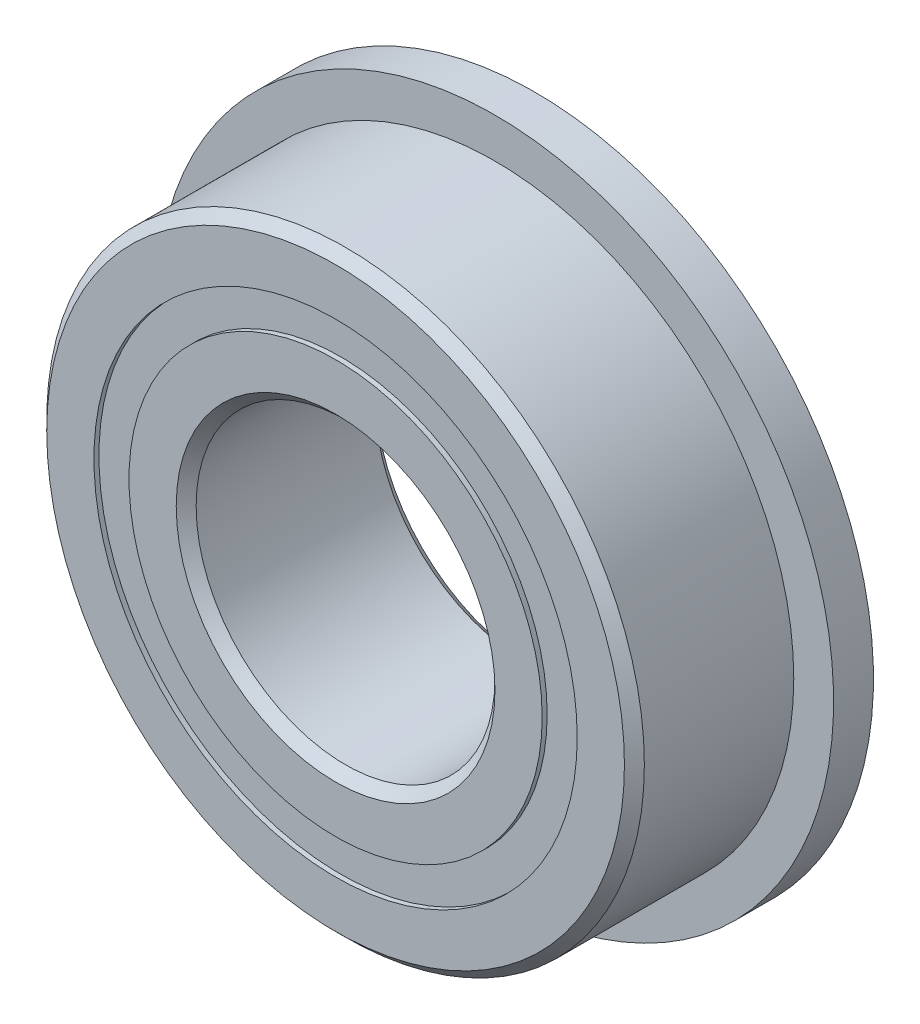
ISO-10303-21;
HEADER;
FILE_DESCRIPTION(('STEP AP214'),'2;1');
FILE_NAME('part.step','',(''),(''),'','','');
FILE_SCHEMA(('AUTOMOTIVE_DESIGN { 1 0 10303 214 1 1 1 1 }'));
ENDSEC;
DATA;
#1=APPLICATION_CONTEXT('core data for automotive mechanical design processes');
#2=APPLICATION_PROTOCOL_DEFINITION('international standard','automotive_design',2000,#1);
#3=PRODUCT_CONTEXT('',#1,'mechanical');
#4=PRODUCT('Part','Part','',(#3));
#5=PRODUCT_RELATED_PRODUCT_CATEGORY('part','',(#4));
#6=PRODUCT_DEFINITION_FORMATION('','',#4);
#7=PRODUCT_DEFINITION_CONTEXT('part definition',#1,'design');
#8=PRODUCT_DEFINITION('design','',#6,#7);
#9=PRODUCT_DEFINITION_SHAPE('','',#8);
#10=(LENGTH_UNIT() NAMED_UNIT(*) SI_UNIT(.MILLI.,.METRE.));
#11=(NAMED_UNIT(*) PLANE_ANGLE_UNIT() SI_UNIT($,.RADIAN.));
#12=(NAMED_UNIT(*) SI_UNIT($,.STERADIAN.) SOLID_ANGLE_UNIT());
#13=UNCERTAINTY_MEASURE_WITH_UNIT(LENGTH_MEASURE(1.E-05),#10,'distance_accuracy_value','');
#14=(GEOMETRIC_REPRESENTATION_CONTEXT(3) GLOBAL_UNCERTAINTY_ASSIGNED_CONTEXT((#13)) GLOBAL_UNIT_ASSIGNED_CONTEXT((#10,
#11,#12)) REPRESENTATION_CONTEXT('',''));
#15=CARTESIAN_POINT('',(0.,0.,0.));
#16=DIRECTION('',(0.,0.,1.));
#17=DIRECTION('',(1.,0.,0.));
#18=AXIS2_PLACEMENT_3D('',#15,#16,#17);
#19=CARTESIAN_POINT('',(0.,4.85164835164835,-1.9));
#20=DIRECTION('',(0.,0.,1.));
#21=DIRECTION('',(1.,0.,0.));
#22=AXIS2_PLACEMENT_3D('',#19,#20,#21);
#23=PLANE('',#22);
#24=CARTESIAN_POINT('',(0.,0.,-1.9));
#25=DIRECTION('',(0.,0.,1.));
#26=DIRECTION('',(1.,0.,0.));
#27=AXIS2_PLACEMENT_3D('',#24,#25,#26);
#28=CIRCLE('',#27,4.85164835164835);
#29=CARTESIAN_POINT('',(4.85164835164835,0.,-1.9));
#30=VERTEX_POINT('',#29);
#31=EDGE_CURVE('E57',#30,#30,#28,.T.);
#32=ORIENTED_EDGE('',*,*,#31,.F.);
#33=EDGE_LOOP('',(#32));
#34=FACE_BOUND('',#33,.T.);
#35=CARTESIAN_POINT('',(0.,0.,-1.9));
#36=DIRECTION('',(0.,0.,1.));
#37=DIRECTION('',(1.,0.,0.));
#38=AXIS2_PLACEMENT_3D('',#35,#36,#37);
#39=CIRCLE('',#38,4.14835164835165);
#40=CARTESIAN_POINT('',(4.14835164835165,0.,-1.9));
#41=VERTEX_POINT('',#40);
#42=EDGE_CURVE('E11',#41,#41,#39,.T.);
#43=ORIENTED_EDGE('',*,*,#42,.T.);
#44=EDGE_LOOP('',(#43));
#45=FACE_BOUND('',#44,.T.);
#46=ADVANCED_FACE('F43',(#34,#45),#23,.F.);
#47=CARTESIAN_POINT('',(0.,0.,2.));
#48=DIRECTION('',(0.,0.,1.));
#49=DIRECTION('',(1.,0.,0.));
#50=AXIS2_PLACEMENT_3D('',#47,#48,#49);
#51=CYLINDRICAL_SURFACE('',#50,4.14835164835165);
#52=ORIENTED_EDGE('',*,*,#42,.F.);
#53=EDGE_LOOP('',(#52));
#54=FACE_BOUND('',#53,.T.);
#55=CARTESIAN_POINT('',(0.,0.,-0.955918417024762));
#56=DIRECTION('',(0.,0.,1.));
#57=DIRECTION('',(1.,0.,0.));
#58=AXIS2_PLACEMENT_3D('',#55,#56,#57);
#59=CIRCLE('',#58,4.14835164835165);
#60=CARTESIAN_POINT('',(4.14835164835165,0.,-0.955918417024762));
#61=VERTEX_POINT('',#60);
#62=EDGE_CURVE('E49',#61,#61,#59,.T.);
#63=ORIENTED_EDGE('',*,*,#62,.T.);
#64=EDGE_LOOP('',(#63));
#65=FACE_BOUND('',#64,.T.);
#66=ADVANCED_FACE('F66',(#54,#65),#51,.F.);
#67=CARTESIAN_POINT('',(0.,4.85164835164835,-0.955918417024762));
#68=DIRECTION('',(0.,0.,-1.));
#69=DIRECTION('',(-1.,0.,0.));
#70=AXIS2_PLACEMENT_3D('',#67,#68,#69);
#71=PLANE('',#70);
#72=ORIENTED_EDGE('',*,*,#62,.F.);
#73=EDGE_LOOP('',(#72));
#74=FACE_BOUND('',#73,.T.);
#75=CARTESIAN_POINT('',(0.,0.,-0.955918417024762));
#76=DIRECTION('',(0.,0.,1.));
#77=DIRECTION('',(1.,0.,0.));
#78=AXIS2_PLACEMENT_3D('',#75,#76,#77);
#79=CIRCLE('',#78,4.85164835164835);
#80=CARTESIAN_POINT('',(4.85164835164835,0.,-0.955918417024762));
#81=VERTEX_POINT('',#80);
#82=EDGE_CURVE('E53',#81,#81,#79,.T.);
#83=ORIENTED_EDGE('',*,*,#82,.T.);
#84=EDGE_LOOP('',(#83));
#85=FACE_BOUND('',#84,.T.);
#86=ADVANCED_FACE('F70',(#74,#85),#71,.F.);
#87=CARTESIAN_POINT('',(0.,0.,2.));
#88=DIRECTION('',(0.,0.,1.));
#89=DIRECTION('',(1.,0.,0.));
#90=AXIS2_PLACEMENT_3D('',#87,#88,#89);
#91=CYLINDRICAL_SURFACE('',#90,4.85164835164835);
#92=ORIENTED_EDGE('',*,*,#82,.F.);
#93=EDGE_LOOP('',(#92));
#94=FACE_BOUND('',#93,.T.);
#95=ORIENTED_EDGE('',*,*,#31,.T.);
#96=EDGE_LOOP('',(#95));
#97=FACE_BOUND('',#96,.T.);
#98=ADVANCED_FACE('F63',(#94,#97),#91,.T.);
#99=CLOSED_SHELL('',(#46,#66,#86,#98));
#100=MANIFOLD_SOLID_BREP('B2',#99);
#101=CARTESIAN_POINT('',(0.,4.85164835164835,1.9));
#102=DIRECTION('',(0.,0.,-1.));
#103=DIRECTION('',(-1.,0.,0.));
#104=AXIS2_PLACEMENT_3D('',#101,#102,#103);
#105=PLANE('',#104);
#106=CARTESIAN_POINT('',(0.,0.,1.9));
#107=DIRECTION('',(0.,0.,1.));
#108=DIRECTION('',(1.,0.,0.));
#109=AXIS2_PLACEMENT_3D('',#106,#107,#108);
#110=CIRCLE('',#109,4.14835164835165);
#111=CARTESIAN_POINT('',(4.14835164835165,0.,1.9));
#112=VERTEX_POINT('',#111);
#113=EDGE_CURVE('E42',#112,#112,#110,.T.);
#114=ORIENTED_EDGE('',*,*,#113,.F.);
#115=EDGE_LOOP('',(#114));
#116=FACE_BOUND('',#115,.T.);
#117=CARTESIAN_POINT('',(0.,0.,1.9));
#118=DIRECTION('',(0.,0.,1.));
#119=DIRECTION('',(1.,0.,0.));
#120=AXIS2_PLACEMENT_3D('',#117,#118,#119);
#121=CIRCLE('',#120,4.85164835164835);
#122=CARTESIAN_POINT('',(4.85164835164835,0.,1.9));
#123=VERTEX_POINT('',#122);
#124=EDGE_CURVE('E125',#123,#123,#121,.T.);
#125=ORIENTED_EDGE('',*,*,#124,.T.);
#126=EDGE_LOOP('',(#125));
#127=FACE_BOUND('',#126,.T.);
#128=ADVANCED_FACE('F111',(#116,#127),#105,.F.);
#129=CARTESIAN_POINT('',(0.,0.,2.));
#130=DIRECTION('',(0.,0.,1.));
#131=DIRECTION('',(1.,0.,0.));
#132=AXIS2_PLACEMENT_3D('',#129,#130,#131);
#133=CYLINDRICAL_SURFACE('',#132,4.14835164835165);
#134=CARTESIAN_POINT('',(0.,0.,0.955918417024761));
#135=DIRECTION('',(0.,0.,1.));
#136=DIRECTION('',(1.,0.,0.));
#137=AXIS2_PLACEMENT_3D('',#134,#135,#136);
#138=CIRCLE('',#137,4.14835164835165);
#139=CARTESIAN_POINT('',(4.14835164835165,0.,0.955918417024761));
#140=VERTEX_POINT('',#139);
#141=EDGE_CURVE('E117',#140,#140,#138,.T.);
#142=ORIENTED_EDGE('',*,*,#141,.F.);
#143=EDGE_LOOP('',(#142));
#144=FACE_BOUND('',#143,.T.);
#145=ORIENTED_EDGE('',*,*,#113,.T.);
#146=EDGE_LOOP('',(#145));
#147=FACE_BOUND('',#146,.T.);
#148=ADVANCED_FACE('F140',(#144,#147),#133,.F.);
#149=CARTESIAN_POINT('',(0.,4.85164835164835,0.955918417024761));
#150=DIRECTION('',(0.,0.,1.));
#151=DIRECTION('',(1.,0.,0.));
#152=AXIS2_PLACEMENT_3D('',#149,#150,#151);
#153=PLANE('',#152);
#154=CARTESIAN_POINT('',(0.,0.,0.955918417024761));
#155=DIRECTION('',(0.,0.,1.));
#156=DIRECTION('',(1.,0.,0.));
#157=AXIS2_PLACEMENT_3D('',#154,#155,#156);
#158=CIRCLE('',#157,4.85164835164835);
#159=CARTESIAN_POINT('',(4.85164835164835,0.,0.955918417024761));
#160=VERTEX_POINT('',#159);
#161=EDGE_CURVE('E121',#160,#160,#158,.T.);
#162=ORIENTED_EDGE('',*,*,#161,.F.);
#163=EDGE_LOOP('',(#162));
#164=FACE_BOUND('',#163,.T.);
#165=ORIENTED_EDGE('',*,*,#141,.T.);
#166=EDGE_LOOP('',(#165));
#167=FACE_BOUND('',#166,.T.);
#168=ADVANCED_FACE('F135',(#164,#167),#153,.F.);
#169=CARTESIAN_POINT('',(0.,0.,2.));
#170=DIRECTION('',(0.,0.,1.));
#171=DIRECTION('',(1.,0.,0.));
#172=AXIS2_PLACEMENT_3D('',#169,#170,#171);
#173=CYLINDRICAL_SURFACE('',#172,4.85164835164835);
#174=ORIENTED_EDGE('',*,*,#124,.F.);
#175=EDGE_LOOP('',(#174));
#176=FACE_BOUND('',#175,.T.);
#177=ORIENTED_EDGE('',*,*,#161,.T.);
#178=EDGE_LOOP('',(#177));
#179=FACE_BOUND('',#178,.T.);
#180=ADVANCED_FACE('F132',(#176,#179),#173,.T.);
#181=CLOSED_SHELL('',(#128,#148,#168,#180));
#182=MANIFOLD_SOLID_BREP('B6',#181);
#183=CARTESIAN_POINT('',(-2.24999999999995,3.89711431703,0.));
#184=DIRECTION('',(0.,0.,1.));
#185=DIRECTION('',(-0.499999999999989,0.866025403784445,0.));
#186=AXIS2_PLACEMENT_3D('',#183,#184,#185);
#187=SPHERICAL_SURFACE('',#186,0.955918417024761);
#188=CARTESIAN_POINT('',(-2.24999999999995,3.89711431703,0.955918417024761));
#189=VERTEX_POINT('',#188);
#190=VERTEX_LOOP('',#189);
#191=FACE_BOUND('',#190,.T.);
#192=ADVANCED_FACE('F181',(#191),#187,.T.);
#193=CLOSED_SHELL('',(#192));
#194=MANIFOLD_SOLID_BREP('B37',#193);
#195=CARTESIAN_POINT('',(-3.89711431702995,2.25000000000005,0.));
#196=DIRECTION('',(0.,0.,1.));
#197=DIRECTION('',(-0.866025403784433,0.50000000000001,0.));
#198=AXIS2_PLACEMENT_3D('',#195,#196,#197);
#199=SPHERICAL_SURFACE('',#198,0.955918417024761);
#200=CARTESIAN_POINT('',(-3.89711431702995,2.25000000000005,0.955918417024761));
#201=VERTEX_POINT('',#200);
#202=VERTEX_LOOP('',#201);
#203=FACE_BOUND('',#202,.T.);
#204=ADVANCED_FACE('F201',(#203),#199,.T.);
#205=CLOSED_SHELL('',(#204));
#206=MANIFOLD_SOLID_BREP('B107',#205);
#207=CARTESIAN_POINT('',(-4.5,0.,0.));
#208=DIRECTION('',(0.,0.,1.));
#209=DIRECTION('',(-1.,0.,0.));
#210=AXIS2_PLACEMENT_3D('',#207,#208,#209);
#211=SPHERICAL_SURFACE('',#210,0.955918417024761);
#212=CARTESIAN_POINT('',(-4.5,0.,0.955918417024761));
#213=VERTEX_POINT('',#212);
#214=VERTEX_LOOP('',#213);
#215=FACE_BOUND('',#214,.T.);
#216=ADVANCED_FACE('F222',(#215),#211,.T.);
#217=CLOSED_SHELL('',(#216));
#218=MANIFOLD_SOLID_BREP('B177',#217);
#219=CARTESIAN_POINT('',(-3.89711431703,-2.24999999999996,0.));
#220=DIRECTION('',(0.,0.,1.));
#221=DIRECTION('',(-0.866025403784443,-0.499999999999992,0.));
#222=AXIS2_PLACEMENT_3D('',#219,#220,#221);
#223=SPHERICAL_SURFACE('',#222,0.955918417024761);
#224=CARTESIAN_POINT('',(-3.89711431703,-2.24999999999996,0.955918417024761));
#225=VERTEX_POINT('',#224);
#226=VERTEX_LOOP('',#225);
#227=FACE_BOUND('',#226,.T.);
#228=ADVANCED_FACE('F245',(#227),#223,.T.);
#229=CLOSED_SHELL('',(#228));
#230=MANIFOLD_SOLID_BREP('B197',#229);
#231=CARTESIAN_POINT('',(-2.25000000000003,-3.89711431702996,0.));
#232=DIRECTION('',(0.,0.,1.));
#233=DIRECTION('',(-0.500000000000007,-0.866025403784435,0.));
#234=AXIS2_PLACEMENT_3D('',#231,#232,#233);
#235=SPHERICAL_SURFACE('',#234,0.955918417024761);
#236=CARTESIAN_POINT('',(-2.25000000000003,-3.89711431702996,0.955918417024761));
#237=VERTEX_POINT('',#236);
#238=VERTEX_LOOP('',#237);
#239=FACE_BOUND('',#238,.T.);
#240=ADVANCED_FACE('F265',(#239),#235,.T.);
#241=CLOSED_SHELL('',(#240));
#242=MANIFOLD_SOLID_BREP('B218',#241);
#243=CARTESIAN_POINT('',(0.,-4.5,0.));
#244=DIRECTION('',(0.,0.,1.));
#245=DIRECTION('',(0.,-1.,0.));
#246=AXIS2_PLACEMENT_3D('',#243,#244,#245);
#247=SPHERICAL_SURFACE('',#246,0.955918417024761);
#248=CARTESIAN_POINT('',(0.,-4.5,0.955918417024761));
#249=VERTEX_POINT('',#248);
#250=VERTEX_LOOP('',#249);
#251=FACE_BOUND('',#250,.T.);
#252=ADVANCED_FACE('F285',(#251),#247,.T.);
#253=CLOSED_SHELL('',(#252));
#254=MANIFOLD_SOLID_BREP('B241',#253);
#255=CARTESIAN_POINT('',(2.24999999999998,-3.89711431702999,0.));
#256=DIRECTION('',(0.,0.,1.));
#257=DIRECTION('',(0.499999999999995,-0.866025403784442,0.));
#258=AXIS2_PLACEMENT_3D('',#255,#256,#257);
#259=SPHERICAL_SURFACE('',#258,0.955918417024761);
#260=CARTESIAN_POINT('',(2.24999999999998,-3.89711431702999,0.955918417024761));
#261=VERTEX_POINT('',#260);
#262=VERTEX_LOOP('',#261);
#263=FACE_BOUND('',#262,.T.);
#264=ADVANCED_FACE('F305',(#263),#259,.T.);
#265=CLOSED_SHELL('',(#264));
#266=MANIFOLD_SOLID_BREP('B261',#265);
#267=CARTESIAN_POINT('',(3.89711431702996,-2.25000000000002,0.));
#268=DIRECTION('',(0.,0.,1.));
#269=DIRECTION('',(0.866025403784436,-0.500000000000004,0.));
#270=AXIS2_PLACEMENT_3D('',#267,#268,#269);
#271=SPHERICAL_SURFACE('',#270,0.955918417024761);
#272=CARTESIAN_POINT('',(3.89711431702996,-2.25000000000002,0.955918417024761));
#273=VERTEX_POINT('',#272);
#274=VERTEX_LOOP('',#273);
#275=FACE_BOUND('',#274,.T.);
#276=ADVANCED_FACE('F325',(#275),#271,.T.);
#277=CLOSED_SHELL('',(#276));
#278=MANIFOLD_SOLID_BREP('B281',#277);
#279=CARTESIAN_POINT('',(4.5,0.,0.));
#280=DIRECTION('',(0.,0.,1.));
#281=DIRECTION('',(1.,0.,0.));
#282=AXIS2_PLACEMENT_3D('',#279,#280,#281);
#283=SPHERICAL_SURFACE('',#282,0.955918417024761);
#284=CARTESIAN_POINT('',(4.5,0.,0.955918417024761));
#285=VERTEX_POINT('',#284);
#286=VERTEX_LOOP('',#285);
#287=FACE_BOUND('',#286,.T.);
#288=ADVANCED_FACE('F345',(#287),#283,.T.);
#289=CLOSED_SHELL('',(#288));
#290=MANIFOLD_SOLID_BREP('B301',#289);
#291=CARTESIAN_POINT('',(3.89711431702998,2.24999999999999,0.));
#292=DIRECTION('',(0.,0.,1.));
#293=DIRECTION('',(0.86602540378444,0.499999999999998,0.));
#294=AXIS2_PLACEMENT_3D('',#291,#292,#293);
#295=SPHERICAL_SURFACE('',#294,0.955918417024761);
#296=CARTESIAN_POINT('',(3.89711431702998,2.24999999999999,0.955918417024761));
#297=VERTEX_POINT('',#296);
#298=VERTEX_LOOP('',#297);
#299=FACE_BOUND('',#298,.T.);
#300=ADVANCED_FACE('F365',(#299),#295,.T.);
#301=CLOSED_SHELL('',(#300));
#302=MANIFOLD_SOLID_BREP('B321',#301);
#303=CARTESIAN_POINT('',(2.25,3.89711431702997,0.));
#304=DIRECTION('',(0.,0.,1.));
#305=DIRECTION('',(0.500000000000001,0.866025403784438,0.));
#306=AXIS2_PLACEMENT_3D('',#303,#304,#305);
#307=SPHERICAL_SURFACE('',#306,0.955918417024761);
#308=CARTESIAN_POINT('',(2.25,3.89711431702997,0.955918417024761));
#309=VERTEX_POINT('',#308);
#310=VERTEX_LOOP('',#309);
#311=FACE_BOUND('',#310,.T.);
#312=ADVANCED_FACE('F385',(#311),#307,.T.);
#313=CLOSED_SHELL('',(#312));
#314=MANIFOLD_SOLID_BREP('B341',#313);
#315=CARTESIAN_POINT('',(0.,4.5,0.));
#316=DIRECTION('',(0.,0.,1.));
#317=DIRECTION('',(0.,1.,0.));
#318=AXIS2_PLACEMENT_3D('',#315,#316,#317);
#319=SPHERICAL_SURFACE('',#318,0.955918417024761);
#320=CARTESIAN_POINT('',(0.,4.5,0.955918417024761));
#321=VERTEX_POINT('',#320);
#322=VERTEX_LOOP('',#321);
#323=FACE_BOUND('',#322,.T.);
#324=ADVANCED_FACE('F408',(#323),#319,.T.);
#325=CLOSED_SHELL('',(#324));
#326=MANIFOLD_SOLID_BREP('B361',#325);
#327=CARTESIAN_POINT('',(0.,4.14835164835165,2.));
#328=DIRECTION('',(0.,0.,-1.));
#329=DIRECTION('',(-1.,0.,0.));
#330=AXIS2_PLACEMENT_3D('',#327,#328,#329);
#331=PLANE('',#330);
#332=CARTESIAN_POINT('',(0.,0.,2.));
#333=DIRECTION('',(0.,0.,1.));
#334=DIRECTION('',(1.,0.,0.));
#335=AXIS2_PLACEMENT_3D('',#332,#333,#334);
#336=CIRCLE('',#335,3.2);
#337=CARTESIAN_POINT('',(3.2,0.,2.));
#338=VERTEX_POINT('',#337);
#339=EDGE_CURVE('E459',#338,#338,#336,.T.);
#340=ORIENTED_EDGE('',*,*,#339,.F.);
#341=EDGE_LOOP('',(#340));
#342=FACE_BOUND('',#341,.T.);
#343=CARTESIAN_POINT('',(0.,0.,2.));
#344=DIRECTION('',(0.,0.,1.));
#345=DIRECTION('',(1.,0.,0.));
#346=AXIS2_PLACEMENT_3D('',#343,#344,#345);
#347=CIRCLE('',#346,4.14835164835165);
#348=CARTESIAN_POINT('',(4.14835164835165,0.,2.));
#349=VERTEX_POINT('',#348);
#350=EDGE_CURVE('E407',#349,#349,#347,.T.);
#351=ORIENTED_EDGE('',*,*,#350,.T.);
#352=EDGE_LOOP('',(#351));
#353=FACE_BOUND('',#352,.T.);
#354=ADVANCED_FACE('F431',(#342,#353),#331,.F.);
#355=CARTESIAN_POINT('',(0.,0.,2.));
#356=DIRECTION('',(0.,0.,1.));
#357=DIRECTION('',(1.,0.,0.));
#358=AXIS2_PLACEMENT_3D('',#355,#356,#357);
#359=CYLINDRICAL_SURFACE('',#358,4.14835164835165);
#360=ORIENTED_EDGE('',*,*,#350,.F.);
#361=EDGE_LOOP('',(#360));
#362=FACE_BOUND('',#361,.T.);
#363=CARTESIAN_POINT('',(0.,0.,0.888888888888889));
#364=DIRECTION('',(0.,0.,1.));
#365=DIRECTION('',(1.,0.,0.));
#366=AXIS2_PLACEMENT_3D('',#363,#364,#365);
#367=CIRCLE('',#366,4.14835164835165);
#368=CARTESIAN_POINT('',(4.14835164835165,0.,0.888888888888889));
#369=VERTEX_POINT('',#368);
#370=EDGE_CURVE('E437',#369,#369,#367,.T.);
#371=ORIENTED_EDGE('',*,*,#370,.T.);
#372=EDGE_LOOP('',(#371));
#373=FACE_BOUND('',#372,.T.);
#374=ADVANCED_FACE('F466',(#362,#373),#359,.T.);
#375=CARTESIAN_POINT('',(0.,0.,0.));
#376=DIRECTION('',(0.,0.,1.));
#377=DIRECTION('',(1.,0.,0.));
#378=AXIS2_PLACEMENT_3D('',#375,#376,#377);
#379=TOROIDAL_SURFACE('',#378,4.5,0.95591841702476);
#380=ORIENTED_EDGE('',*,*,#370,.F.);
#381=EDGE_LOOP('',(#380));
#382=FACE_BOUND('',#381,.T.);
#383=CARTESIAN_POINT('',(0.,0.,-0.88888888888889));
#384=DIRECTION('',(0.,0.,1.));
#385=DIRECTION('',(1.,0.,0.));
#386=AXIS2_PLACEMENT_3D('',#383,#384,#385);
#387=CIRCLE('',#386,4.14835164835165);
#388=CARTESIAN_POINT('',(4.14835164835165,0.,-0.88888888888889));
#389=VERTEX_POINT('',#388);
#390=EDGE_CURVE('E441',#389,#389,#387,.T.);
#391=ORIENTED_EDGE('',*,*,#390,.T.);
#392=EDGE_LOOP('',(#391));
#393=FACE_BOUND('',#392,.T.);
#394=ADVANCED_FACE('F470',(#382,#393),#379,.F.);
#395=CARTESIAN_POINT('',(0.,0.,2.));
#396=DIRECTION('',(0.,0.,1.));
#397=DIRECTION('',(1.,0.,0.));
#398=AXIS2_PLACEMENT_3D('',#395,#396,#397);
#399=CYLINDRICAL_SURFACE('',#398,4.14835164835165);
#400=ORIENTED_EDGE('',*,*,#390,.F.);
#401=EDGE_LOOP('',(#400));
#402=FACE_BOUND('',#401,.T.);
#403=CARTESIAN_POINT('',(0.,0.,-2.));
#404=DIRECTION('',(0.,0.,1.));
#405=DIRECTION('',(1.,0.,0.));
#406=AXIS2_PLACEMENT_3D('',#403,#404,#405);
#407=CIRCLE('',#406,4.14835164835165);
#408=CARTESIAN_POINT('',(4.14835164835165,0.,-2.));
#409=VERTEX_POINT('',#408);
#410=EDGE_CURVE('E445',#409,#409,#407,.T.);
#411=ORIENTED_EDGE('',*,*,#410,.T.);
#412=EDGE_LOOP('',(#411));
#413=FACE_BOUND('',#412,.T.);
#414=ADVANCED_FACE('F475',(#402,#413),#399,.T.);
#415=CARTESIAN_POINT('',(0.,3.2,-2.));
#416=DIRECTION('',(0.,0.,1.));
#417=DIRECTION('',(1.,0.,0.));
#418=AXIS2_PLACEMENT_3D('',#415,#416,#417);
#419=PLANE('',#418);
#420=ORIENTED_EDGE('',*,*,#410,.F.);
#421=EDGE_LOOP('',(#420));
#422=FACE_BOUND('',#421,.T.);
#423=CARTESIAN_POINT('',(0.,0.,-2.));
#424=DIRECTION('',(0.,0.,1.));
#425=DIRECTION('',(1.,0.,0.));
#426=AXIS2_PLACEMENT_3D('',#423,#424,#425);
#427=CIRCLE('',#426,3.2);
#428=CARTESIAN_POINT('',(3.2,0.,-2.));
#429=VERTEX_POINT('',#428);
#430=EDGE_CURVE('E450',#429,#429,#427,.T.);
#431=ORIENTED_EDGE('',*,*,#430,.T.);
#432=EDGE_LOOP('',(#431));
#433=FACE_BOUND('',#432,.T.);
#434=ADVANCED_FACE('F481',(#422,#433),#419,.F.);
#435=CARTESIAN_POINT('',(0.,0.,-1.8));
#436=DIRECTION('',(0.,0.,-1.));
#437=DIRECTION('',(-1.,0.,0.));
#438=AXIS2_PLACEMENT_3D('',#435,#436,#437);
#439=CONICAL_SURFACE('',#438,3.,0.785398163397452);
#440=ORIENTED_EDGE('',*,*,#430,.F.);
#441=EDGE_LOOP('',(#440));
#442=FACE_BOUND('',#441,.T.);
#443=CARTESIAN_POINT('',(0.,0.,-1.8));
#444=DIRECTION('',(0.,0.,1.));
#445=DIRECTION('',(1.,0.,0.));
#446=AXIS2_PLACEMENT_3D('',#443,#444,#445);
#447=CIRCLE('',#446,3.);
#448=CARTESIAN_POINT('',(3.,0.,-1.8));
#449=VERTEX_POINT('',#448);
#450=EDGE_CURVE('E453',#449,#449,#447,.T.);
#451=ORIENTED_EDGE('',*,*,#450,.T.);
#452=EDGE_LOOP('',(#451));
#453=FACE_BOUND('',#452,.T.);
#454=ADVANCED_FACE('F485',(#442,#453),#439,.F.);
#455=CARTESIAN_POINT('',(0.,0.,2.));
#456=DIRECTION('',(0.,0.,1.));
#457=DIRECTION('',(1.,0.,0.));
#458=AXIS2_PLACEMENT_3D('',#455,#456,#457);
#459=CYLINDRICAL_SURFACE('',#458,3.);
#460=ORIENTED_EDGE('',*,*,#450,.F.);
#461=EDGE_LOOP('',(#460));
#462=FACE_BOUND('',#461,.T.);
#463=CARTESIAN_POINT('',(0.,0.,1.8));
#464=DIRECTION('',(0.,0.,1.));
#465=DIRECTION('',(1.,0.,0.));
#466=AXIS2_PLACEMENT_3D('',#463,#464,#465);
#467=CIRCLE('',#466,3.);
#468=CARTESIAN_POINT('',(3.,0.,1.8));
#469=VERTEX_POINT('',#468);
#470=EDGE_CURVE('E456',#469,#469,#467,.T.);
#471=ORIENTED_EDGE('',*,*,#470,.T.);
#472=EDGE_LOOP('',(#471));
#473=FACE_BOUND('',#472,.T.);
#474=ADVANCED_FACE('F489',(#462,#473),#459,.F.);
#475=CARTESIAN_POINT('',(0.,0.,2.));
#476=DIRECTION('',(0.,0.,1.));
#477=DIRECTION('',(1.,0.,0.));
#478=AXIS2_PLACEMENT_3D('',#475,#476,#477);
#479=CONICAL_SURFACE('',#478,3.2,0.785398163397443);
#480=ORIENTED_EDGE('',*,*,#470,.F.);
#481=EDGE_LOOP('',(#480));
#482=FACE_BOUND('',#481,.T.);
#483=ORIENTED_EDGE('',*,*,#339,.T.);
#484=EDGE_LOOP('',(#483));
#485=FACE_BOUND('',#484,.T.);
#486=ADVANCED_FACE('F463',(#482,#485),#479,.F.);
#487=CLOSED_SHELL('',(#354,#374,#394,#414,#434,#454,#474,#486));
#488=MANIFOLD_SOLID_BREP('B381',#487);
#489=CARTESIAN_POINT('',(0.,0.,1.8));
#490=DIRECTION('',(0.,0.,-1.));
#491=DIRECTION('',(-1.,0.,0.));
#492=AXIS2_PLACEMENT_3D('',#489,#490,#491);
#493=CONICAL_SURFACE('',#492,6.,0.785398163397449);
#494=CARTESIAN_POINT('',(0.,0.,2.));
#495=DIRECTION('',(0.,0.,1.));
#496=DIRECTION('',(1.,0.,0.));
#497=AXIS2_PLACEMENT_3D('',#494,#495,#496);
#498=CIRCLE('',#497,5.8);
#499=CARTESIAN_POINT('',(5.8,0.,2.));
#500=VERTEX_POINT('',#499);
#501=EDGE_CURVE('E577',#500,#500,#498,.T.);
#502=ORIENTED_EDGE('',*,*,#501,.F.);
#503=EDGE_LOOP('',(#502));
#504=FACE_BOUND('',#503,.T.);
#505=CARTESIAN_POINT('',(0.,0.,1.8));
#506=DIRECTION('',(0.,0.,1.));
#507=DIRECTION('',(1.,0.,0.));
#508=AXIS2_PLACEMENT_3D('',#505,#506,#507);
#509=CIRCLE('',#508,6.);
#510=CARTESIAN_POINT('',(6.,0.,1.8));
#511=VERTEX_POINT('',#510);
#512=EDGE_CURVE('E430',#511,#511,#509,.T.);
#513=ORIENTED_EDGE('',*,*,#512,.T.);
#514=EDGE_LOOP('',(#513));
#515=FACE_BOUND('',#514,.T.);
#516=ADVANCED_FACE('F555',(#504,#515),#493,.T.);
#517=CARTESIAN_POINT('',(0.,0.,2.));
#518=DIRECTION('',(0.,0.,1.));
#519=DIRECTION('',(1.,0.,0.));
#520=AXIS2_PLACEMENT_3D('',#517,#518,#519);
#521=CYLINDRICAL_SURFACE('',#520,6.);
#522=CARTESIAN_POINT('',(0.,0.,-1.2));
#523=DIRECTION('',(0.,0.,1.));
#524=DIRECTION('',(1.,0.,0.));
#525=AXIS2_PLACEMENT_3D('',#522,#523,#524);
#526=CIRCLE('',#525,6.);
#527=CARTESIAN_POINT('',(6.,0.,-1.2));
#528=VERTEX_POINT('',#527);
#529=EDGE_CURVE('E580',#528,#528,#526,.T.);
#530=ORIENTED_EDGE('',*,*,#529,.T.);
#531=EDGE_LOOP('',(#530));
#532=FACE_BOUND('',#531,.T.);
#533=ORIENTED_EDGE('',*,*,#512,.F.);
#534=EDGE_LOOP('',(#533));
#535=FACE_BOUND('',#534,.T.);
#536=ADVANCED_FACE('F600',(#532,#535),#521,.T.);
#537=CARTESIAN_POINT('',(0.,5.8,-2.));
#538=DIRECTION('',(0.,0.,1.));
#539=DIRECTION('',(1.,0.,0.));
#540=AXIS2_PLACEMENT_3D('',#537,#538,#539);
#541=PLANE('',#540);
#542=CARTESIAN_POINT('',(0.,0.,-2.));
#543=DIRECTION('',(0.,0.,1.));
#544=DIRECTION('',(1.,0.,0.));
#545=AXIS2_PLACEMENT_3D('',#542,#543,#544);
#546=CIRCLE('',#545,4.85164835164835);
#547=CARTESIAN_POINT('',(4.85164835164835,0.,-2.));
#548=VERTEX_POINT('',#547);
#549=EDGE_CURVE('E561',#548,#548,#546,.T.);
#550=ORIENTED_EDGE('',*,*,#549,.T.);
#551=EDGE_LOOP('',(#550));
#552=FACE_BOUND('',#551,.T.);
#553=CARTESIAN_POINT('',(0.,0.,-2.));
#554=DIRECTION('',(0.,0.,-1.));
#555=DIRECTION('',(-1.,0.,0.));
#556=AXIS2_PLACEMENT_3D('',#553,#554,#555);
#557=CIRCLE('',#556,6.8);
#558=CARTESIAN_POINT('',(-6.8,0.,-2.));
#559=VERTEX_POINT('',#558);
#560=EDGE_CURVE('E583',#559,#559,#557,.T.);
#561=ORIENTED_EDGE('',*,*,#560,.T.);
#562=EDGE_LOOP('',(#561));
#563=FACE_BOUND('',#562,.T.);
#564=ADVANCED_FACE('F603',(#552,#563),#541,.F.);
#565=CARTESIAN_POINT('',(0.,0.,2.));
#566=DIRECTION('',(0.,0.,1.));
#567=DIRECTION('',(1.,0.,0.));
#568=AXIS2_PLACEMENT_3D('',#565,#566,#567);
#569=CYLINDRICAL_SURFACE('',#568,4.85164835164835);
#570=CARTESIAN_POINT('',(0.,0.,-0.888888888888889));
#571=DIRECTION('',(0.,0.,1.));
#572=DIRECTION('',(1.,0.,0.));
#573=AXIS2_PLACEMENT_3D('',#570,#571,#572);
#574=CIRCLE('',#573,4.85164835164835);
#575=CARTESIAN_POINT('',(4.85164835164835,0.,-0.888888888888889));
#576=VERTEX_POINT('',#575);
#577=EDGE_CURVE('E565',#576,#576,#574,.T.);
#578=ORIENTED_EDGE('',*,*,#577,.T.);
#579=EDGE_LOOP('',(#578));
#580=FACE_BOUND('',#579,.T.);
#581=ORIENTED_EDGE('',*,*,#549,.F.);
#582=EDGE_LOOP('',(#581));
#583=FACE_BOUND('',#582,.T.);
#584=ADVANCED_FACE('F608',(#580,#583),#569,.F.);
#585=CARTESIAN_POINT('',(0.,0.,0.));
#586=DIRECTION('',(0.,0.,1.));
#587=DIRECTION('',(1.,0.,0.));
#588=AXIS2_PLACEMENT_3D('',#585,#586,#587);
#589=TOROIDAL_SURFACE('',#588,4.5,0.955918417024761);
#590=ORIENTED_EDGE('',*,*,#577,.F.);
#591=EDGE_LOOP('',(#590));
#592=FACE_BOUND('',#591,.T.);
#593=CARTESIAN_POINT('',(0.,0.,0.888888888888889));
#594=DIRECTION('',(0.,0.,1.));
#595=DIRECTION('',(1.,0.,0.));
#596=AXIS2_PLACEMENT_3D('',#593,#594,#595);
#597=CIRCLE('',#596,4.85164835164835);
#598=CARTESIAN_POINT('',(4.85164835164835,0.,0.888888888888889));
#599=VERTEX_POINT('',#598);
#600=EDGE_CURVE('E569',#599,#599,#597,.T.);
#601=ORIENTED_EDGE('',*,*,#600,.T.);
#602=EDGE_LOOP('',(#601));
#603=FACE_BOUND('',#602,.T.);
#604=ADVANCED_FACE('F614',(#592,#603),#589,.F.);
#605=CARTESIAN_POINT('',(0.,0.,2.));
#606=DIRECTION('',(0.,0.,1.));
#607=DIRECTION('',(1.,0.,0.));
#608=AXIS2_PLACEMENT_3D('',#605,#606,#607);
#609=CYLINDRICAL_SURFACE('',#608,4.85164835164835);
#610=ORIENTED_EDGE('',*,*,#600,.F.);
#611=EDGE_LOOP('',(#610));
#612=FACE_BOUND('',#611,.T.);
#613=CARTESIAN_POINT('',(0.,0.,2.));
#614=DIRECTION('',(0.,0.,1.));
#615=DIRECTION('',(1.,0.,0.));
#616=AXIS2_PLACEMENT_3D('',#613,#614,#615);
#617=CIRCLE('',#616,4.85164835164835);
#618=CARTESIAN_POINT('',(4.85164835164835,0.,2.));
#619=VERTEX_POINT('',#618);
#620=EDGE_CURVE('E574',#619,#619,#617,.T.);
#621=ORIENTED_EDGE('',*,*,#620,.T.);
#622=EDGE_LOOP('',(#621));
#623=FACE_BOUND('',#622,.T.);
#624=ADVANCED_FACE('F618',(#612,#623),#609,.F.);
#625=CARTESIAN_POINT('',(0.,5.8,2.));
#626=DIRECTION('',(0.,0.,-1.));
#627=DIRECTION('',(-1.,0.,0.));
#628=AXIS2_PLACEMENT_3D('',#625,#626,#627);
#629=PLANE('',#628);
#630=ORIENTED_EDGE('',*,*,#620,.F.);
#631=EDGE_LOOP('',(#630));
#632=FACE_BOUND('',#631,.T.);
#633=ORIENTED_EDGE('',*,*,#501,.T.);
#634=EDGE_LOOP('',(#633));
#635=FACE_BOUND('',#634,.T.);
#636=ADVANCED_FACE('F596',(#632,#635),#629,.F.);
#637=CARTESIAN_POINT('',(0.,4.85164835164835,-1.2));
#638=DIRECTION('',(0.,0.,1.));
#639=DIRECTION('',(1.,0.,0.));
#640=AXIS2_PLACEMENT_3D('',#637,#638,#639);
#641=PLANE('',#640);
#642=CARTESIAN_POINT('',(0.,0.,-1.2));
#643=DIRECTION('',(0.,0.,-1.));
#644=DIRECTION('',(-1.,0.,0.));
#645=AXIS2_PLACEMENT_3D('',#642,#643,#644);
#646=CIRCLE('',#645,6.8);
#647=CARTESIAN_POINT('',(-6.8,0.,-1.2));
#648=VERTEX_POINT('',#647);
#649=EDGE_CURVE('E586',#648,#648,#646,.T.);
#650=ORIENTED_EDGE('',*,*,#649,.F.);
#651=EDGE_LOOP('',(#650));
#652=FACE_BOUND('',#651,.T.);
#653=ORIENTED_EDGE('',*,*,#529,.F.);
#654=EDGE_LOOP('',(#653));
#655=FACE_BOUND('',#654,.T.);
#656=ADVANCED_FACE('F593',(#652,#655),#641,.T.);
#657=CARTESIAN_POINT('',(0.,0.,-2.));
#658=DIRECTION('',(0.,0.,-1.));
#659=DIRECTION('',(-1.,0.,0.));
#660=AXIS2_PLACEMENT_3D('',#657,#658,#659);
#661=CYLINDRICAL_SURFACE('',#660,6.8);
#662=ORIENTED_EDGE('',*,*,#649,.T.);
#663=EDGE_LOOP('',(#662));
#664=FACE_BOUND('',#663,.T.);
#665=ORIENTED_EDGE('',*,*,#560,.F.);
#666=EDGE_LOOP('',(#665));
#667=FACE_BOUND('',#666,.T.);
#668=ADVANCED_FACE('F590',(#664,#667),#661,.T.);
#669=CLOSED_SHELL('',(#516,#536,#564,#584,#604,#624,#636,#656,#668));
#670=MANIFOLD_SOLID_BREP('B402',#669);
#671=ADVANCED_BREP_SHAPE_REPRESENTATION('',(#18,#100,#182,#194,#206,#218,#230,#242,#254,#266,
#278,#290,#302,#314,#326,#488,#670),#14);
#672=SHAPE_DEFINITION_REPRESENTATION(#9,#671);
ENDSEC;
END-ISO-10303-21;
